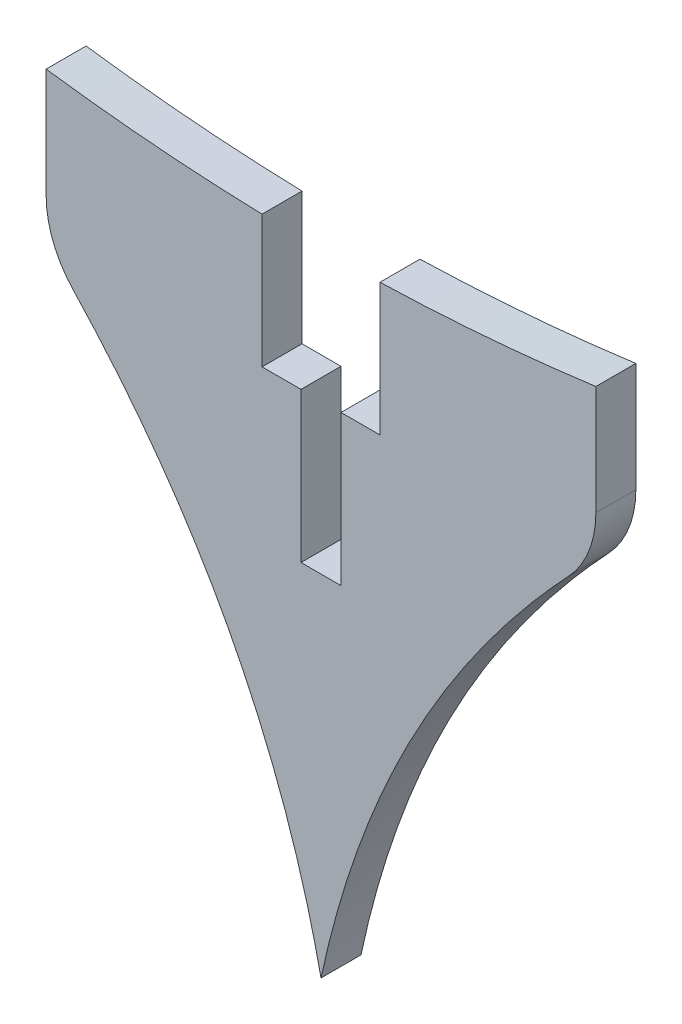
ISO-10303-21;
HEADER;
FILE_DESCRIPTION(('STEP AP214'),'2;1');
FILE_NAME('part.step','',(''),(''),'','','');
FILE_SCHEMA(('AUTOMOTIVE_DESIGN { 1 0 10303 214 1 1 1 1 }'));
ENDSEC;
DATA;
#1=APPLICATION_CONTEXT('core data for automotive mechanical design processes');
#2=APPLICATION_PROTOCOL_DEFINITION('international standard','automotive_design',2000,#1);
#3=PRODUCT_CONTEXT('',#1,'mechanical');
#4=PRODUCT('Part','Part','',(#3));
#5=PRODUCT_RELATED_PRODUCT_CATEGORY('part','',(#4));
#6=PRODUCT_DEFINITION_FORMATION('','',#4);
#7=PRODUCT_DEFINITION_CONTEXT('part definition',#1,'design');
#8=PRODUCT_DEFINITION('design','',#6,#7);
#9=PRODUCT_DEFINITION_SHAPE('','',#8);
#10=(LENGTH_UNIT() NAMED_UNIT(*) SI_UNIT(.MILLI.,.METRE.));
#11=(NAMED_UNIT(*) PLANE_ANGLE_UNIT() SI_UNIT($,.RADIAN.));
#12=(NAMED_UNIT(*) SI_UNIT($,.STERADIAN.) SOLID_ANGLE_UNIT());
#13=UNCERTAINTY_MEASURE_WITH_UNIT(LENGTH_MEASURE(1.E-05),#10,'distance_accuracy_value','');
#14=(GEOMETRIC_REPRESENTATION_CONTEXT(3) GLOBAL_UNCERTAINTY_ASSIGNED_CONTEXT((#13)) GLOBAL_UNIT_ASSIGNED_CONTEXT((#10,
#11,#12)) REPRESENTATION_CONTEXT('',''));
#15=CARTESIAN_POINT('',(0.,0.,0.));
#16=DIRECTION('',(0.,0.,1.));
#17=DIRECTION('',(1.,0.,0.));
#18=AXIS2_PLACEMENT_3D('',#15,#16,#17);
#19=CARTESIAN_POINT('',(-5.9,17.5,4.));
#20=DIRECTION('',(0.,-1.,0.));
#21=DIRECTION('',(0.,0.,-1.));
#22=AXIS2_PLACEMENT_3D('',#19,#20,#21);
#23=PLANE('',#22);
#24=DIRECTION('',(-1.,0.,0.));
#25=VECTOR('',#24,1.);
#26=CARTESIAN_POINT('',(-5.9,17.5,0.));
#27=LINE('',#26,#25);
#28=CARTESIAN_POINT('',(-2.,17.5,0.));
#29=VERTEX_POINT('',#28);
#30=CARTESIAN_POINT('',(-5.9,17.5,0.));
#31=VERTEX_POINT('',#30);
#32=EDGE_CURVE('E175',#29,#31,#27,.T.);
#33=ORIENTED_EDGE('',*,*,#32,.T.);
#34=DIRECTION('',(0.,0.,-1.));
#35=VECTOR('',#34,1.);
#36=CARTESIAN_POINT('',(-5.9,17.5,4.));
#37=LINE('',#36,#35);
#38=CARTESIAN_POINT('',(-5.9,17.5,4.));
#39=VERTEX_POINT('',#38);
#40=EDGE_CURVE('E154',#39,#31,#37,.T.);
#41=ORIENTED_EDGE('',*,*,#40,.F.);
#42=DIRECTION('',(-1.,0.,0.));
#43=VECTOR('',#42,1.);
#44=CARTESIAN_POINT('',(-5.9,17.5,4.));
#45=LINE('',#44,#43);
#46=CARTESIAN_POINT('',(-2.,17.5,4.));
#47=VERTEX_POINT('',#46);
#48=EDGE_CURVE('E161',#47,#39,#45,.T.);
#49=ORIENTED_EDGE('',*,*,#48,.F.);
#50=DIRECTION('',(0.,0.,-1.));
#51=VECTOR('',#50,1.);
#52=CARTESIAN_POINT('',(-2.,17.5,4.));
#53=LINE('',#52,#51);
#54=EDGE_CURVE('E247',#47,#29,#53,.T.);
#55=ORIENTED_EDGE('',*,*,#54,.T.);
#56=EDGE_LOOP('',(#33,#41,#49,#55));
#57=FACE_BOUND('',#56,.T.);
#58=ADVANCED_FACE('F42',(#57),#23,.F.);
#59=CARTESIAN_POINT('',(-5.9,30.732034208664,4.));
#60=DIRECTION('',(-1.,0.,0.));
#61=DIRECTION('',(0.,-1.,0.));
#62=AXIS2_PLACEMENT_3D('',#59,#60,#61);
#63=PLANE('',#62);
#64=DIRECTION('',(0.,1.,0.));
#65=VECTOR('',#64,1.);
#66=CARTESIAN_POINT('',(-5.9,30.732034208664,0.));
#67=LINE('',#66,#65);
#68=CARTESIAN_POINT('',(-5.9,30.732034208664,0.));
#69=VERTEX_POINT('',#68);
#70=EDGE_CURVE('E296',#31,#69,#67,.T.);
#71=ORIENTED_EDGE('',*,*,#70,.T.);
#72=DIRECTION('',(0.,0.,-1.));
#73=VECTOR('',#72,1.);
#74=CARTESIAN_POINT('',(-5.9,30.732034208664,4.));
#75=LINE('',#74,#73);
#76=CARTESIAN_POINT('',(-5.9,30.732034208664,4.));
#77=VERTEX_POINT('',#76);
#78=EDGE_CURVE('E157',#77,#69,#75,.T.);
#79=ORIENTED_EDGE('',*,*,#78,.F.);
#80=DIRECTION('',(0.,1.,0.));
#81=VECTOR('',#80,1.);
#82=CARTESIAN_POINT('',(-5.9,30.732034208664,4.));
#83=LINE('',#82,#81);
#84=EDGE_CURVE('E150',#39,#77,#83,.T.);
#85=ORIENTED_EDGE('',*,*,#84,.F.);
#86=ORIENTED_EDGE('',*,*,#40,.T.);
#87=EDGE_LOOP('',(#71,#79,#85,#86));
#88=FACE_BOUND('',#87,.T.);
#89=ADVANCED_FACE('F152',(#88),#63,.F.);
#90=CARTESIAN_POINT('',(0.,235.647114180832,4.));
#91=DIRECTION('',(0.,0.,-1.));
#92=DIRECTION('',(-1.,0.,0.));
#93=AXIS2_PLACEMENT_3D('',#90,#91,#92);
#94=CYLINDRICAL_SURFACE('',#93,205.);
#95=CARTESIAN_POINT('',(0.,235.647114180832,0.));
#96=DIRECTION('',(0.,0.,-1.));
#97=DIRECTION('',(1.,0.,0.));
#98=AXIS2_PLACEMENT_3D('',#95,#96,#97);
#99=CIRCLE('',#98,205.);
#100=CARTESIAN_POINT('',(-27.5000000000001,32.5,0.));
#101=VERTEX_POINT('',#100);
#102=EDGE_CURVE('E290',#69,#101,#99,.T.);
#103=ORIENTED_EDGE('',*,*,#102,.T.);
#104=DIRECTION('',(0.,0.,-1.));
#105=VECTOR('',#104,1.);
#106=CARTESIAN_POINT('',(-27.5000000000001,32.5,4.));
#107=LINE('',#106,#105);
#108=CARTESIAN_POINT('',(-27.5000000000001,32.5,4.));
#109=VERTEX_POINT('',#108);
#110=EDGE_CURVE('E185',#109,#101,#107,.T.);
#111=ORIENTED_EDGE('',*,*,#110,.F.);
#112=CARTESIAN_POINT('',(0.,235.647114180832,4.));
#113=DIRECTION('',(0.,0.,-1.));
#114=DIRECTION('',(1.,0.,0.));
#115=AXIS2_PLACEMENT_3D('',#112,#113,#114);
#116=CIRCLE('',#115,205.);
#117=EDGE_CURVE('E160',#77,#109,#116,.T.);
#118=ORIENTED_EDGE('',*,*,#117,.F.);
#119=ORIENTED_EDGE('',*,*,#78,.T.);
#120=EDGE_LOOP('',(#103,#111,#118,#119));
#121=FACE_BOUND('',#120,.T.);
#122=ADVANCED_FACE('F353',(#121),#94,.F.);
#123=CARTESIAN_POINT('',(-27.5,32.5,4.));
#124=DIRECTION('',(1.,0.,0.));
#125=DIRECTION('',(0.,1.,0.));
#126=AXIS2_PLACEMENT_3D('',#123,#124,#125);
#127=PLANE('',#126);
#128=DIRECTION('',(0.,-1.,0.));
#129=VECTOR('',#128,1.);
#130=CARTESIAN_POINT('',(-27.5,32.5,0.));
#131=LINE('',#130,#129);
#132=CARTESIAN_POINT('',(-27.5,21.5609487754941,0.));
#133=VERTEX_POINT('',#132);
#134=EDGE_CURVE('E285',#101,#133,#131,.T.);
#135=ORIENTED_EDGE('',*,*,#134,.T.);
#136=DIRECTION('',(0.,0.,-1.));
#137=VECTOR('',#136,1.);
#138=CARTESIAN_POINT('',(-27.5,21.5609487754941,4.));
#139=LINE('',#138,#137);
#140=CARTESIAN_POINT('',(-27.5,21.5609487754941,4.));
#141=VERTEX_POINT('',#140);
#142=EDGE_CURVE('E194',#133,#141,#139,.F.);
#143=ORIENTED_EDGE('',*,*,#142,.T.);
#144=DIRECTION('',(0.,-1.,0.));
#145=VECTOR('',#144,1.);
#146=CARTESIAN_POINT('',(-27.5,32.5,4.));
#147=LINE('',#146,#145);
#148=EDGE_CURVE('E287',#109,#141,#147,.T.);
#149=ORIENTED_EDGE('',*,*,#148,.F.);
#150=ORIENTED_EDGE('',*,*,#110,.T.);
#151=EDGE_LOOP('',(#135,#143,#149,#150));
#152=FACE_BOUND('',#151,.T.);
#153=ADVANCED_FACE('F284',(#152),#127,.F.);
#154=CARTESIAN_POINT('',(-27.5,17.5,4.));
#155=CARTESIAN_POINT('',(-6.12943225494576,-3.70084211152424,4.));
#156=CARTESIAN_POINT('',(0.,-32.5,4.));
#157=B_SPLINE_CURVE_WITH_KNOTS('',2,(#154,#155,#156),.UNSPECIFIED.,.F.,.F.,(3,3),(0.,1.),.UNSPECIFIED.);
#158=DIRECTION('',(0.,0.,-1.));
#159=VECTOR('',#158,1.);
#160=SURFACE_OF_LINEAR_EXTRUSION('',#157,#159);
#161=CARTESIAN_POINT('',(-24.7882911537817,14.7139923671542,4.));
#162=VERTEX_POINT('',#161);
#163=CARTESIAN_POINT('',(0.,-32.5,4.));
#164=VERTEX_POINT('',#163);
#165=EDGE_CURVE('E333',#162,#164,#157,.T.);
#166=ORIENTED_EDGE('',*,*,#165,.F.);
#167=DIRECTION('',(0.,0.,-1.));
#168=VECTOR('',#167,1.);
#169=CARTESIAN_POINT('',(-24.7882911537808,14.7139923671532,4.));
#170=LINE('',#169,#168);
#171=CARTESIAN_POINT('',(-24.7882911537817,14.7139923671542,0.));
#172=VERTEX_POINT('',#171);
#173=EDGE_CURVE('E177',#162,#172,#170,.T.);
#174=ORIENTED_EDGE('',*,*,#173,.T.);
#175=CARTESIAN_POINT('',(-27.5,17.5,0.));
#176=CARTESIAN_POINT('',(-6.12943225494576,-3.70084211152424,0.));
#177=CARTESIAN_POINT('',(0.,-32.5,0.));
#178=B_SPLINE_CURVE_WITH_KNOTS('',2,(#175,#176,#177),.UNSPECIFIED.,.F.,.F.,(3,3),(0.,1.),.UNSPECIFIED.);
#179=CARTESIAN_POINT('',(0.,-32.5,0.));
#180=VERTEX_POINT('',#179);
#181=EDGE_CURVE('E228',#172,#180,#178,.T.);
#182=ORIENTED_EDGE('',*,*,#181,.T.);
#183=DIRECTION('',(0.,0.,-1.));
#184=VECTOR('',#183,1.);
#185=CARTESIAN_POINT('',(0.,-32.5,4.));
#186=LINE('',#185,#184);
#187=EDGE_CURVE('E273',#164,#180,#186,.T.);
#188=ORIENTED_EDGE('',*,*,#187,.F.);
#189=EDGE_LOOP('',(#166,#174,#182,#188));
#190=FACE_BOUND('',#189,.T.);
#191=ADVANCED_FACE('F346',(#190),#160,.F.);
#192=CARTESIAN_POINT('',(0.,-32.5,4.));
#193=CARTESIAN_POINT('',(6.12943225494577,-3.70084211152423,4.));
#194=CARTESIAN_POINT('',(27.5,17.5,4.));
#195=B_SPLINE_CURVE_WITH_KNOTS('',2,(#192,#193,#194),.UNSPECIFIED.,.F.,.F.,(3,3),(0.,1.),.UNSPECIFIED.);
#196=DIRECTION('',(0.,0.,-1.));
#197=VECTOR('',#196,1.);
#198=SURFACE_OF_LINEAR_EXTRUSION('',#195,#197);
#199=CARTESIAN_POINT('',(0.,-32.5,0.));
#200=CARTESIAN_POINT('',(6.12943225494577,-3.70084211152423,0.));
#201=CARTESIAN_POINT('',(27.5,17.5,0.));
#202=B_SPLINE_CURVE_WITH_KNOTS('',2,(#199,#200,#201),.UNSPECIFIED.,.F.,.F.,(3,3),(0.,1.),.UNSPECIFIED.);
#203=CARTESIAN_POINT('',(24.7882911537817,14.7139923671542,0.));
#204=VERTEX_POINT('',#203);
#205=EDGE_CURVE('E221',#180,#204,#202,.T.);
#206=ORIENTED_EDGE('',*,*,#205,.T.);
#207=DIRECTION('',(0.,0.,-1.));
#208=VECTOR('',#207,1.);
#209=CARTESIAN_POINT('',(24.7882911537808,14.7139923671532,0.));
#210=LINE('',#209,#208);
#211=CARTESIAN_POINT('',(24.7882911537817,14.7139923671542,4.));
#212=VERTEX_POINT('',#211);
#213=EDGE_CURVE('E11',#204,#212,#210,.F.);
#214=ORIENTED_EDGE('',*,*,#213,.T.);
#215=EDGE_CURVE('E327',#164,#212,#195,.T.);
#216=ORIENTED_EDGE('',*,*,#215,.F.);
#217=ORIENTED_EDGE('',*,*,#187,.T.);
#218=EDGE_LOOP('',(#206,#214,#216,#217));
#219=FACE_BOUND('',#218,.T.);
#220=ADVANCED_FACE('F342',(#219),#198,.F.);
#221=CARTESIAN_POINT('',(27.5,32.5,4.));
#222=DIRECTION('',(-1.,0.,0.));
#223=DIRECTION('',(0.,-1.,0.));
#224=AXIS2_PLACEMENT_3D('',#221,#222,#223);
#225=PLANE('',#224);
#226=DIRECTION('',(0.,1.,0.));
#227=VECTOR('',#226,1.);
#228=CARTESIAN_POINT('',(27.5,32.5,4.));
#229=LINE('',#228,#227);
#230=CARTESIAN_POINT('',(27.5,21.5609487754941,4.));
#231=VERTEX_POINT('',#230);
#232=CARTESIAN_POINT('',(27.5,32.5,4.));
#233=VERTEX_POINT('',#232);
#234=EDGE_CURVE('E211',#231,#233,#229,.T.);
#235=ORIENTED_EDGE('',*,*,#234,.F.);
#236=DIRECTION('',(0.,0.,-1.));
#237=VECTOR('',#236,1.);
#238=CARTESIAN_POINT('',(27.5,21.5609487754941,4.));
#239=LINE('',#238,#237);
#240=CARTESIAN_POINT('',(27.5,21.5609487754941,0.));
#241=VERTEX_POINT('',#240);
#242=EDGE_CURVE('E51',#231,#241,#239,.T.);
#243=ORIENTED_EDGE('',*,*,#242,.T.);
#244=DIRECTION('',(0.,1.,0.));
#245=VECTOR('',#244,1.);
#246=CARTESIAN_POINT('',(27.5,32.5,0.));
#247=LINE('',#246,#245);
#248=CARTESIAN_POINT('',(27.5,32.5,0.));
#249=VERTEX_POINT('',#248);
#250=EDGE_CURVE('E209',#241,#249,#247,.T.);
#251=ORIENTED_EDGE('',*,*,#250,.T.);
#252=DIRECTION('',(0.,0.,-1.));
#253=VECTOR('',#252,1.);
#254=CARTESIAN_POINT('',(27.5,32.5,4.));
#255=LINE('',#254,#253);
#256=EDGE_CURVE('E270',#233,#249,#255,.T.);
#257=ORIENTED_EDGE('',*,*,#256,.F.);
#258=EDGE_LOOP('',(#235,#243,#251,#257));
#259=FACE_BOUND('',#258,.T.);
#260=ADVANCED_FACE('F207',(#259),#225,.F.);
#261=CARTESIAN_POINT('',(0.,235.647114180832,4.));
#262=DIRECTION('',(0.,0.,-1.));
#263=DIRECTION('',(-1.,0.,0.));
#264=AXIS2_PLACEMENT_3D('',#261,#262,#263);
#265=CYLINDRICAL_SURFACE('',#264,205.);
#266=CARTESIAN_POINT('',(0.,235.647114180832,0.));
#267=DIRECTION('',(0.,0.,-1.));
#268=DIRECTION('',(1.,0.,0.));
#269=AXIS2_PLACEMENT_3D('',#266,#267,#268);
#270=CIRCLE('',#269,205.);
#271=CARTESIAN_POINT('',(5.90000000000006,30.732034208664,0.));
#272=VERTEX_POINT('',#271);
#273=EDGE_CURVE('E219',#249,#272,#270,.T.);
#274=ORIENTED_EDGE('',*,*,#273,.T.);
#275=DIRECTION('',(0.,0.,-1.));
#276=VECTOR('',#275,1.);
#277=CARTESIAN_POINT('',(5.90000000000006,30.732034208664,4.));
#278=LINE('',#277,#276);
#279=CARTESIAN_POINT('',(5.90000000000006,30.732034208664,4.));
#280=VERTEX_POINT('',#279);
#281=EDGE_CURVE('E266',#280,#272,#278,.T.);
#282=ORIENTED_EDGE('',*,*,#281,.F.);
#283=CARTESIAN_POINT('',(0.,235.647114180832,4.));
#284=DIRECTION('',(0.,0.,-1.));
#285=DIRECTION('',(1.,0.,0.));
#286=AXIS2_PLACEMENT_3D('',#283,#284,#285);
#287=CIRCLE('',#286,205.);
#288=EDGE_CURVE('E322',#233,#280,#287,.T.);
#289=ORIENTED_EDGE('',*,*,#288,.F.);
#290=ORIENTED_EDGE('',*,*,#256,.T.);
#291=EDGE_LOOP('',(#274,#282,#289,#290));
#292=FACE_BOUND('',#291,.T.);
#293=ADVANCED_FACE('F425',(#292),#265,.F.);
#294=CARTESIAN_POINT('',(5.9,30.732034208664,4.));
#295=DIRECTION('',(1.,0.,0.));
#296=DIRECTION('',(0.,1.,0.));
#297=AXIS2_PLACEMENT_3D('',#294,#295,#296);
#298=PLANE('',#297);
#299=DIRECTION('',(0.,-1.,0.));
#300=VECTOR('',#299,1.);
#301=CARTESIAN_POINT('',(5.9,30.732034208664,0.));
#302=LINE('',#301,#300);
#303=CARTESIAN_POINT('',(5.9,17.5,0.));
#304=VERTEX_POINT('',#303);
#305=EDGE_CURVE('E226',#272,#304,#302,.T.);
#306=ORIENTED_EDGE('',*,*,#305,.T.);
#307=DIRECTION('',(0.,0.,-1.));
#308=VECTOR('',#307,1.);
#309=CARTESIAN_POINT('',(5.9,17.5,4.));
#310=LINE('',#309,#308);
#311=CARTESIAN_POINT('',(5.9,17.5,4.));
#312=VERTEX_POINT('',#311);
#313=EDGE_CURVE('E262',#312,#304,#310,.T.);
#314=ORIENTED_EDGE('',*,*,#313,.F.);
#315=DIRECTION('',(0.,-1.,0.));
#316=VECTOR('',#315,1.);
#317=CARTESIAN_POINT('',(5.9,30.732034208664,4.));
#318=LINE('',#317,#316);
#319=EDGE_CURVE('E319',#280,#312,#318,.T.);
#320=ORIENTED_EDGE('',*,*,#319,.F.);
#321=ORIENTED_EDGE('',*,*,#281,.T.);
#322=EDGE_LOOP('',(#306,#314,#320,#321));
#323=FACE_BOUND('',#322,.T.);
#324=ADVANCED_FACE('F422',(#323),#298,.F.);
#325=CARTESIAN_POINT('',(5.9,17.5,4.));
#326=DIRECTION('',(0.,-1.,0.));
#327=DIRECTION('',(0.,0.,-1.));
#328=AXIS2_PLACEMENT_3D('',#325,#326,#327);
#329=PLANE('',#328);
#330=DIRECTION('',(-1.,0.,0.));
#331=VECTOR('',#330,1.);
#332=CARTESIAN_POINT('',(5.9,17.5,0.));
#333=LINE('',#332,#331);
#334=CARTESIAN_POINT('',(2.,17.5,0.));
#335=VERTEX_POINT('',#334);
#336=EDGE_CURVE('E236',#304,#335,#333,.T.);
#337=ORIENTED_EDGE('',*,*,#336,.T.);
#338=DIRECTION('',(0.,0.,-1.));
#339=VECTOR('',#338,1.);
#340=CARTESIAN_POINT('',(2.,17.5,4.));
#341=LINE('',#340,#339);
#342=CARTESIAN_POINT('',(2.,17.5,4.));
#343=VERTEX_POINT('',#342);
#344=EDGE_CURVE('E258',#343,#335,#341,.T.);
#345=ORIENTED_EDGE('',*,*,#344,.F.);
#346=DIRECTION('',(-1.,0.,0.));
#347=VECTOR('',#346,1.);
#348=CARTESIAN_POINT('',(5.9,17.5,4.));
#349=LINE('',#348,#347);
#350=EDGE_CURVE('E316',#312,#343,#349,.T.);
#351=ORIENTED_EDGE('',*,*,#350,.F.);
#352=ORIENTED_EDGE('',*,*,#313,.T.);
#353=EDGE_LOOP('',(#337,#345,#351,#352));
#354=FACE_BOUND('',#353,.T.);
#355=ADVANCED_FACE('F418',(#354),#329,.F.);
#356=CARTESIAN_POINT('',(2.,17.5,4.));
#357=DIRECTION('',(1.,0.,0.));
#358=DIRECTION('',(0.,1.,0.));
#359=AXIS2_PLACEMENT_3D('',#356,#357,#358);
#360=PLANE('',#359);
#361=DIRECTION('',(0.,-1.,0.));
#362=VECTOR('',#361,1.);
#363=CARTESIAN_POINT('',(2.,17.5,0.));
#364=LINE('',#363,#362);
#365=CARTESIAN_POINT('',(2.,2.5,0.));
#366=VERTEX_POINT('',#365);
#367=EDGE_CURVE('E239',#335,#366,#364,.T.);
#368=ORIENTED_EDGE('',*,*,#367,.T.);
#369=DIRECTION('',(0.,0.,-1.));
#370=VECTOR('',#369,1.);
#371=CARTESIAN_POINT('',(2.,2.5,4.));
#372=LINE('',#371,#370);
#373=CARTESIAN_POINT('',(2.,2.5,4.));
#374=VERTEX_POINT('',#373);
#375=EDGE_CURVE('E254',#374,#366,#372,.T.);
#376=ORIENTED_EDGE('',*,*,#375,.F.);
#377=DIRECTION('',(0.,-1.,0.));
#378=VECTOR('',#377,1.);
#379=CARTESIAN_POINT('',(2.,17.5,4.));
#380=LINE('',#379,#378);
#381=EDGE_CURVE('E313',#343,#374,#380,.T.);
#382=ORIENTED_EDGE('',*,*,#381,.F.);
#383=ORIENTED_EDGE('',*,*,#344,.T.);
#384=EDGE_LOOP('',(#368,#376,#382,#383));
#385=FACE_BOUND('',#384,.T.);
#386=ADVANCED_FACE('F414',(#385),#360,.F.);
#387=CARTESIAN_POINT('',(-2.,2.5,4.));
#388=DIRECTION('',(0.,-1.,0.));
#389=DIRECTION('',(1.,0.,0.));
#390=AXIS2_PLACEMENT_3D('',#387,#388,#389);
#391=PLANE('',#390);
#392=DIRECTION('',(-1.,0.,0.));
#393=VECTOR('',#392,1.);
#394=CARTESIAN_POINT('',(-2.,2.5,0.));
#395=LINE('',#394,#393);
#396=CARTESIAN_POINT('',(-2.,2.5,0.));
#397=VERTEX_POINT('',#396);
#398=EDGE_CURVE('E242',#366,#397,#395,.T.);
#399=ORIENTED_EDGE('',*,*,#398,.T.);
#400=DIRECTION('',(0.,0.,-1.));
#401=VECTOR('',#400,1.);
#402=CARTESIAN_POINT('',(-2.,2.5,4.));
#403=LINE('',#402,#401);
#404=CARTESIAN_POINT('',(-2.,2.5,4.));
#405=VERTEX_POINT('',#404);
#406=EDGE_CURVE('E250',#405,#397,#403,.T.);
#407=ORIENTED_EDGE('',*,*,#406,.F.);
#408=DIRECTION('',(-1.,0.,0.));
#409=VECTOR('',#408,1.);
#410=CARTESIAN_POINT('',(-2.,2.5,4.));
#411=LINE('',#410,#409);
#412=EDGE_CURVE('E310',#374,#405,#411,.T.);
#413=ORIENTED_EDGE('',*,*,#412,.F.);
#414=ORIENTED_EDGE('',*,*,#375,.T.);
#415=EDGE_LOOP('',(#399,#407,#413,#414));
#416=FACE_BOUND('',#415,.T.);
#417=ADVANCED_FACE('F410',(#416),#391,.F.);
#418=CARTESIAN_POINT('',(-2.,17.5,4.));
#419=DIRECTION('',(-1.,0.,0.));
#420=DIRECTION('',(0.,-1.,0.));
#421=AXIS2_PLACEMENT_3D('',#418,#419,#420);
#422=PLANE('',#421);
#423=DIRECTION('',(0.,1.,0.));
#424=VECTOR('',#423,1.);
#425=CARTESIAN_POINT('',(-2.,17.5,0.));
#426=LINE('',#425,#424);
#427=EDGE_CURVE('E172',#397,#29,#426,.T.);
#428=ORIENTED_EDGE('',*,*,#427,.T.);
#429=ORIENTED_EDGE('',*,*,#54,.F.);
#430=DIRECTION('',(0.,1.,0.));
#431=VECTOR('',#430,1.);
#432=CARTESIAN_POINT('',(-2.,17.5,4.));
#433=LINE('',#432,#431);
#434=EDGE_CURVE('E167',#405,#47,#433,.T.);
#435=ORIENTED_EDGE('',*,*,#434,.F.);
#436=ORIENTED_EDGE('',*,*,#406,.T.);
#437=EDGE_LOOP('',(#428,#429,#435,#436));
#438=FACE_BOUND('',#437,.T.);
#439=ADVANCED_FACE('F405',(#438),#422,.F.);
#440=CARTESIAN_POINT('',(0.,235.647114180832,4.));
#441=DIRECTION('',(0.,0.,1.));
#442=DIRECTION('',(1.,0.,0.));
#443=AXIS2_PLACEMENT_3D('',#440,#441,#442);
#444=PLANE('',#443);
#445=ORIENTED_EDGE('',*,*,#148,.T.);
#446=CARTESIAN_POINT('',(-17.5,21.5609487754941,4.));
#447=DIRECTION('',(0.,0.,1.));
#448=DIRECTION('',(1.,0.,0.));
#449=AXIS2_PLACEMENT_3D('',#446,#447,#448);
#450=CIRCLE('',#449,10.);
#451=EDGE_CURVE('E199',#141,#162,#450,.T.);
#452=ORIENTED_EDGE('',*,*,#451,.T.);
#453=ORIENTED_EDGE('',*,*,#165,.T.);
#454=ORIENTED_EDGE('',*,*,#215,.T.);
#455=CARTESIAN_POINT('',(17.5,21.5609487754941,4.));
#456=DIRECTION('',(0.,0.,1.));
#457=DIRECTION('',(1.,0.,0.));
#458=AXIS2_PLACEMENT_3D('',#455,#456,#457);
#459=CIRCLE('',#458,10.);
#460=EDGE_CURVE('E58',#212,#231,#459,.T.);
#461=ORIENTED_EDGE('',*,*,#460,.T.);
#462=ORIENTED_EDGE('',*,*,#234,.T.);
#463=ORIENTED_EDGE('',*,*,#288,.T.);
#464=ORIENTED_EDGE('',*,*,#319,.T.);
#465=ORIENTED_EDGE('',*,*,#350,.T.);
#466=ORIENTED_EDGE('',*,*,#381,.T.);
#467=ORIENTED_EDGE('',*,*,#412,.T.);
#468=ORIENTED_EDGE('',*,*,#434,.T.);
#469=ORIENTED_EDGE('',*,*,#48,.T.);
#470=ORIENTED_EDGE('',*,*,#84,.T.);
#471=ORIENTED_EDGE('',*,*,#117,.T.);
#472=EDGE_LOOP('',(#445,#452,#453,#454,#461,#462,#463,#464,#465,#466,#467,#468,#469,#470,#471));
#473=FACE_BOUND('',#472,.T.);
#474=ADVANCED_FACE('F165',(#473),#444,.T.);
#475=CARTESIAN_POINT('',(0.,235.647114180832,0.));
#476=DIRECTION('',(0.,0.,1.));
#477=DIRECTION('',(1.,0.,0.));
#478=AXIS2_PLACEMENT_3D('',#475,#476,#477);
#479=PLANE('',#478);
#480=ORIENTED_EDGE('',*,*,#181,.F.);
#481=CARTESIAN_POINT('',(-17.5,21.5609487754941,0.));
#482=DIRECTION('',(0.,0.,1.));
#483=DIRECTION('',(1.,0.,0.));
#484=AXIS2_PLACEMENT_3D('',#481,#482,#483);
#485=CIRCLE('',#484,10.);
#486=EDGE_CURVE('E191',#172,#133,#485,.F.);
#487=ORIENTED_EDGE('',*,*,#486,.T.);
#488=ORIENTED_EDGE('',*,*,#134,.F.);
#489=ORIENTED_EDGE('',*,*,#102,.F.);
#490=ORIENTED_EDGE('',*,*,#70,.F.);
#491=ORIENTED_EDGE('',*,*,#32,.F.);
#492=ORIENTED_EDGE('',*,*,#427,.F.);
#493=ORIENTED_EDGE('',*,*,#398,.F.);
#494=ORIENTED_EDGE('',*,*,#367,.F.);
#495=ORIENTED_EDGE('',*,*,#336,.F.);
#496=ORIENTED_EDGE('',*,*,#305,.F.);
#497=ORIENTED_EDGE('',*,*,#273,.F.);
#498=ORIENTED_EDGE('',*,*,#250,.F.);
#499=CARTESIAN_POINT('',(17.5,21.5609487754941,0.));
#500=DIRECTION('',(0.,0.,1.));
#501=DIRECTION('',(1.,0.,0.));
#502=AXIS2_PLACEMENT_3D('',#499,#500,#501);
#503=CIRCLE('',#502,10.);
#504=EDGE_CURVE('E183',#241,#204,#503,.F.);
#505=ORIENTED_EDGE('',*,*,#504,.T.);
#506=ORIENTED_EDGE('',*,*,#205,.F.);
#507=EDGE_LOOP('',(#480,#487,#488,#489,#490,#491,#492,#493,#494,#495,#496,#497,#498,#505,#506));
#508=FACE_BOUND('',#507,.T.);
#509=ADVANCED_FACE('F216',(#508),#479,.F.);
#510=CARTESIAN_POINT('',(-17.5,21.5609487754941,2.));
#511=DIRECTION('',(0.,0.,-1.));
#512=DIRECTION('',(-1.,0.,0.));
#513=AXIS2_PLACEMENT_3D('',#510,#511,#512);
#514=CYLINDRICAL_SURFACE('',#513,10.);
#515=ORIENTED_EDGE('',*,*,#451,.F.);
#516=ORIENTED_EDGE('',*,*,#142,.F.);
#517=ORIENTED_EDGE('',*,*,#486,.F.);
#518=ORIENTED_EDGE('',*,*,#173,.F.);
#519=EDGE_LOOP('',(#515,#516,#517,#518));
#520=FACE_BOUND('',#519,.T.);
#521=ADVANCED_FACE('F359',(#520),#514,.T.);
#522=CARTESIAN_POINT('',(17.5,21.5609487754941,2.));
#523=DIRECTION('',(0.,0.,-1.));
#524=DIRECTION('',(-1.,0.,0.));
#525=AXIS2_PLACEMENT_3D('',#522,#523,#524);
#526=CYLINDRICAL_SURFACE('',#525,10.);
#527=ORIENTED_EDGE('',*,*,#460,.F.);
#528=ORIENTED_EDGE('',*,*,#213,.F.);
#529=ORIENTED_EDGE('',*,*,#504,.F.);
#530=ORIENTED_EDGE('',*,*,#242,.F.);
#531=EDGE_LOOP('',(#527,#528,#529,#530));
#532=FACE_BOUND('',#531,.T.);
#533=ADVANCED_FACE('F44',(#532),#526,.T.);
#534=CLOSED_SHELL('',(#58,#89,#122,#153,#191,#220,#260,#293,#324,#355,#386,#417,#439,#474,#509,
#521,#533));
#535=MANIFOLD_SOLID_BREP('B2',#534);
#536=ADVANCED_BREP_SHAPE_REPRESENTATION('',(#18,#535),#14);
#537=SHAPE_DEFINITION_REPRESENTATION(#9,#536);
ENDSEC;
END-ISO-10303-21;
